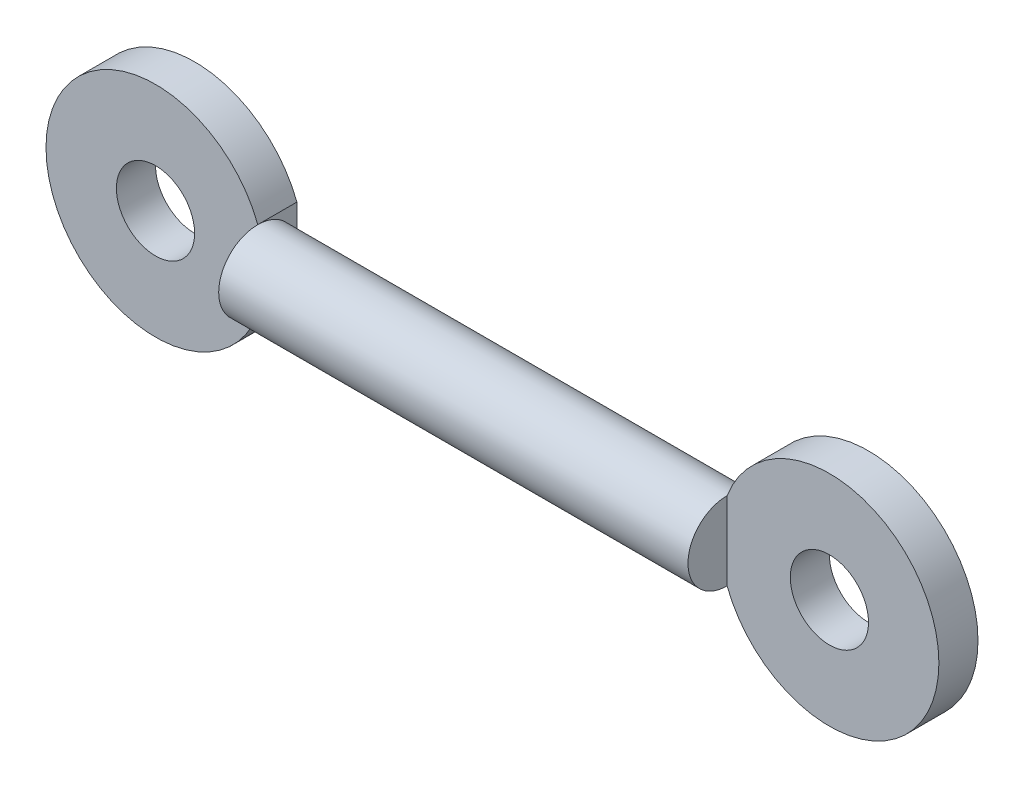
ISO-10303-21;
HEADER;
FILE_DESCRIPTION(('STEP AP214'),'2;1');
FILE_NAME('part.step','',(''),(''),'','','');
FILE_SCHEMA(('AUTOMOTIVE_DESIGN { 1 0 10303 214 1 1 1 1 }'));
ENDSEC;
DATA;
#1=APPLICATION_CONTEXT('core data for automotive mechanical design processes');
#2=APPLICATION_PROTOCOL_DEFINITION('international standard','automotive_design',2000,#1);
#3=PRODUCT_CONTEXT('',#1,'mechanical');
#4=PRODUCT('Part','Part','',(#3));
#5=PRODUCT_RELATED_PRODUCT_CATEGORY('part','',(#4));
#6=PRODUCT_DEFINITION_FORMATION('','',#4);
#7=PRODUCT_DEFINITION_CONTEXT('part definition',#1,'design');
#8=PRODUCT_DEFINITION('design','',#6,#7);
#9=PRODUCT_DEFINITION_SHAPE('','',#8);
#10=(LENGTH_UNIT() NAMED_UNIT(*) SI_UNIT(.MILLI.,.METRE.));
#11=(NAMED_UNIT(*) PLANE_ANGLE_UNIT() SI_UNIT($,.RADIAN.));
#12=(NAMED_UNIT(*) SI_UNIT($,.STERADIAN.) SOLID_ANGLE_UNIT());
#13=UNCERTAINTY_MEASURE_WITH_UNIT(LENGTH_MEASURE(1.E-05),#10,'distance_accuracy_value','');
#14=(GEOMETRIC_REPRESENTATION_CONTEXT(3) GLOBAL_UNCERTAINTY_ASSIGNED_CONTEXT((#13)) GLOBAL_UNIT_ASSIGNED_CONTEXT((#10,
#11,#12)) REPRESENTATION_CONTEXT('',''));
#15=CARTESIAN_POINT('',(0.,0.,0.));
#16=DIRECTION('',(0.,0.,1.));
#17=DIRECTION('',(1.,0.,0.));
#18=AXIS2_PLACEMENT_3D('',#15,#16,#17);
#19=CARTESIAN_POINT('',(15.,0.,0.));
#20=DIRECTION('',(-1.,0.,0.));
#21=DIRECTION('',(0.,-1.,0.));
#22=AXIS2_PLACEMENT_3D('',#19,#20,#21);
#23=PLANE('',#22);
#24=DIRECTION('',(0.,-1.,0.));
#25=VECTOR('',#24,1.);
#26=CARTESIAN_POINT('',(15.,2.50000000000001,0.));
#27=LINE('',#26,#25);
#28=CARTESIAN_POINT('',(15.,2.50000000000001,0.));
#29=VERTEX_POINT('',#28);
#30=CARTESIAN_POINT('',(15.,-2.49999999999999,0.));
#31=VERTEX_POINT('',#30);
#32=EDGE_CURVE('E209',#29,#31,#27,.T.);
#33=ORIENTED_EDGE('',*,*,#32,.F.);
#34=CARTESIAN_POINT('',(15.,0.,0.));
#35=DIRECTION('',(-1.,0.,0.));
#36=DIRECTION('',(0.,-1.,0.));
#37=AXIS2_PLACEMENT_3D('',#34,#35,#36);
#38=CIRCLE('',#37,2.5);
#39=EDGE_CURVE('E228',#31,#29,#38,.T.);
#40=ORIENTED_EDGE('',*,*,#39,.F.);
#41=EDGE_LOOP('',(#33,#40));
#42=FACE_BOUND('',#41,.T.);
#43=ADVANCED_FACE('F45',(#42),#23,.F.);
#44=CARTESIAN_POINT('',(-15.,0.,0.));
#45=DIRECTION('',(-1.,0.,0.));
#46=DIRECTION('',(0.,-1.,0.));
#47=AXIS2_PLACEMENT_3D('',#44,#45,#46);
#48=CYLINDRICAL_SURFACE('',#47,2.5);
#49=ORIENTED_EDGE('',*,*,#39,.T.);
#50=CARTESIAN_POINT('',(15.,0.,-2.5));
#51=VERTEX_POINT('',#50);
#52=EDGE_CURVE('E69',#29,#51,#38,.T.);
#53=ORIENTED_EDGE('',*,*,#52,.T.);
#54=EDGE_CURVE('E225',#51,#31,#38,.T.);
#55=ORIENTED_EDGE('',*,*,#54,.T.);
#56=EDGE_LOOP('',(#49,#53,#55));
#57=FACE_BOUND('',#56,.T.);
#58=CARTESIAN_POINT('',(-15.,0.,0.));
#59=DIRECTION('',(-1.,0.,0.));
#60=DIRECTION('',(0.,-1.,0.));
#61=AXIS2_PLACEMENT_3D('',#58,#59,#60);
#62=CIRCLE('',#61,2.5);
#63=CARTESIAN_POINT('',(-15.,-2.5,0.));
#64=VERTEX_POINT('',#63);
#65=CARTESIAN_POINT('',(-15.,2.5,0.));
#66=VERTEX_POINT('',#65);
#67=EDGE_CURVE('E11',#64,#66,#62,.T.);
#68=ORIENTED_EDGE('',*,*,#67,.F.);
#69=CARTESIAN_POINT('',(-15.,0.,-2.5));
#70=VERTEX_POINT('',#69);
#71=EDGE_CURVE('E55',#70,#64,#62,.T.);
#72=ORIENTED_EDGE('',*,*,#71,.F.);
#73=EDGE_CURVE('E54',#66,#70,#62,.T.);
#74=ORIENTED_EDGE('',*,*,#73,.F.);
#75=EDGE_LOOP('',(#68,#72,#74));
#76=FACE_BOUND('',#75,.T.);
#77=ADVANCED_FACE('F47',(#57,#76),#48,.T.);
#78=CARTESIAN_POINT('',(-15.,-2.5,0.));
#79=DIRECTION('',(1.,0.,0.));
#80=DIRECTION('',(0.,1.,0.));
#81=AXIS2_PLACEMENT_3D('',#78,#79,#80);
#82=PLANE('',#81);
#83=ORIENTED_EDGE('',*,*,#67,.T.);
#84=DIRECTION('',(0.,1.,0.));
#85=VECTOR('',#84,1.);
#86=CARTESIAN_POINT('',(-15.,-2.5,0.));
#87=LINE('',#86,#85);
#88=EDGE_CURVE('E111',#64,#66,#87,.T.);
#89=ORIENTED_EDGE('',*,*,#88,.F.);
#90=EDGE_LOOP('',(#83,#89));
#91=FACE_BOUND('',#90,.T.);
#92=ADVANCED_FACE('F123',(#91),#82,.F.);
#93=CARTESIAN_POINT('',(15.,2.50000000000001,-2.5));
#94=DIRECTION('',(-1.,0.,0.));
#95=DIRECTION('',(0.,0.,1.));
#96=AXIS2_PLACEMENT_3D('',#93,#94,#95);
#97=PLANE('',#96);
#98=DIRECTION('',(0.,0.,1.));
#99=VECTOR('',#98,1.);
#100=CARTESIAN_POINT('',(15.,-2.49999999999999,-2.5));
#101=LINE('',#100,#99);
#102=CARTESIAN_POINT('',(15.,-2.49999999999999,-2.5));
#103=VERTEX_POINT('',#102);
#104=EDGE_CURVE('E221',#103,#31,#101,.T.);
#105=ORIENTED_EDGE('',*,*,#104,.T.);
#106=ORIENTED_EDGE('',*,*,#54,.F.);
#107=DIRECTION('',(0.,-1.,0.));
#108=VECTOR('',#107,1.);
#109=CARTESIAN_POINT('',(15.,2.50000000000001,-2.5));
#110=LINE('',#109,#108);
#111=EDGE_CURVE('E208',#51,#103,#110,.T.);
#112=ORIENTED_EDGE('',*,*,#111,.T.);
#113=EDGE_LOOP('',(#105,#106,#112));
#114=FACE_BOUND('',#113,.T.);
#115=ADVANCED_FACE('F125',(#114),#97,.T.);
#116=CARTESIAN_POINT('',(21.538348415311,0.,-2.5));
#117=DIRECTION('',(0.,0.,1.));
#118=DIRECTION('',(1.,0.,0.));
#119=AXIS2_PLACEMENT_3D('',#116,#117,#118);
#120=CYLINDRICAL_SURFACE('',#119,7.);
#121=CARTESIAN_POINT('',(21.538348415311,0.,0.));
#122=DIRECTION('',(0.,0.,1.));
#123=DIRECTION('',(-1.,0.,0.));
#124=AXIS2_PLACEMENT_3D('',#121,#122,#123);
#125=CIRCLE('',#124,7.);
#126=EDGE_CURVE('E200',#31,#29,#125,.T.);
#127=ORIENTED_EDGE('',*,*,#126,.F.);
#128=ORIENTED_EDGE('',*,*,#104,.F.);
#129=CARTESIAN_POINT('',(21.538348415311,0.,-2.5));
#130=DIRECTION('',(0.,0.,1.));
#131=DIRECTION('',(-1.,0.,0.));
#132=AXIS2_PLACEMENT_3D('',#129,#130,#131);
#133=CIRCLE('',#132,7.);
#134=CARTESIAN_POINT('',(15.,2.50000000000001,-2.5));
#135=VERTEX_POINT('',#134);
#136=EDGE_CURVE('E204',#103,#135,#133,.T.);
#137=ORIENTED_EDGE('',*,*,#136,.T.);
#138=DIRECTION('',(0.,0.,1.));
#139=VECTOR('',#138,1.);
#140=CARTESIAN_POINT('',(15.,2.50000000000001,-2.5));
#141=LINE('',#140,#139);
#142=EDGE_CURVE('E214',#135,#29,#141,.T.);
#143=ORIENTED_EDGE('',*,*,#142,.T.);
#144=EDGE_LOOP('',(#127,#128,#137,#143));
#145=FACE_BOUND('',#144,.T.);
#146=ADVANCED_FACE('F130',(#145),#120,.T.);
#147=EDGE_CURVE('E210',#135,#51,#110,.T.);
#148=ORIENTED_EDGE('',*,*,#147,.T.);
#149=ORIENTED_EDGE('',*,*,#52,.F.);
#150=ORIENTED_EDGE('',*,*,#142,.F.);
#151=EDGE_LOOP('',(#148,#149,#150));
#152=FACE_BOUND('',#151,.T.);
#153=ADVANCED_FACE('F133',(#152),#97,.T.);
#154=CARTESIAN_POINT('',(21.538348415311,0.,-2.5));
#155=DIRECTION('',(0.,0.,-1.));
#156=DIRECTION('',(-1.,0.,0.));
#157=AXIS2_PLACEMENT_3D('',#154,#155,#156);
#158=PLANE('',#157);
#159=CARTESIAN_POINT('',(21.538348415311,0.,-2.5));
#160=DIRECTION('',(0.,0.,1.));
#161=DIRECTION('',(1.,0.,0.));
#162=AXIS2_PLACEMENT_3D('',#159,#160,#161);
#163=CIRCLE('',#162,2.5);
#164=CARTESIAN_POINT('',(24.038348415311,0.,-2.5));
#165=VERTEX_POINT('',#164);
#166=EDGE_CURVE('E196',#165,#165,#163,.T.);
#167=ORIENTED_EDGE('',*,*,#166,.T.);
#168=EDGE_LOOP('',(#167));
#169=FACE_BOUND('',#168,.T.);
#170=ORIENTED_EDGE('',*,*,#136,.F.);
#171=ORIENTED_EDGE('',*,*,#111,.F.);
#172=ORIENTED_EDGE('',*,*,#147,.F.);
#173=EDGE_LOOP('',(#170,#171,#172));
#174=FACE_BOUND('',#173,.T.);
#175=ADVANCED_FACE('F144',(#169,#174),#158,.T.);
#176=CARTESIAN_POINT('',(21.538348415311,0.,0.));
#177=DIRECTION('',(0.,0.,-1.));
#178=DIRECTION('',(-1.,0.,0.));
#179=AXIS2_PLACEMENT_3D('',#176,#177,#178);
#180=PLANE('',#179);
#181=CARTESIAN_POINT('',(21.538348415311,0.,0.));
#182=DIRECTION('',(0.,0.,1.));
#183=DIRECTION('',(1.,0.,0.));
#184=AXIS2_PLACEMENT_3D('',#181,#182,#183);
#185=CIRCLE('',#184,2.5);
#186=CARTESIAN_POINT('',(24.038348415311,0.,0.));
#187=VERTEX_POINT('',#186);
#188=EDGE_CURVE('E192',#187,#187,#185,.T.);
#189=ORIENTED_EDGE('',*,*,#188,.F.);
#190=EDGE_LOOP('',(#189));
#191=FACE_BOUND('',#190,.T.);
#192=ORIENTED_EDGE('',*,*,#126,.T.);
#193=ORIENTED_EDGE('',*,*,#32,.T.);
#194=EDGE_LOOP('',(#192,#193));
#195=FACE_BOUND('',#194,.T.);
#196=ADVANCED_FACE('F146',(#191,#195),#180,.F.);
#197=CARTESIAN_POINT('',(21.538348415311,0.,-2.5));
#198=DIRECTION('',(0.,0.,1.));
#199=DIRECTION('',(1.,0.,0.));
#200=AXIS2_PLACEMENT_3D('',#197,#198,#199);
#201=CYLINDRICAL_SURFACE('',#200,2.5);
#202=ORIENTED_EDGE('',*,*,#166,.F.);
#203=EDGE_LOOP('',(#202));
#204=FACE_BOUND('',#203,.T.);
#205=ORIENTED_EDGE('',*,*,#188,.T.);
#206=EDGE_LOOP('',(#205));
#207=FACE_BOUND('',#206,.T.);
#208=ADVANCED_FACE('F149',(#204,#207),#201,.F.);
#209=CARTESIAN_POINT('',(-15.,-2.5,-2.5));
#210=DIRECTION('',(1.,0.,0.));
#211=DIRECTION('',(0.,0.,-1.));
#212=AXIS2_PLACEMENT_3D('',#209,#210,#211);
#213=PLANE('',#212);
#214=DIRECTION('',(0.,1.,0.));
#215=VECTOR('',#214,1.);
#216=CARTESIAN_POINT('',(-15.,-2.5,-2.5));
#217=LINE('',#216,#215);
#218=CARTESIAN_POINT('',(-15.,-2.5,-2.5));
#219=VERTEX_POINT('',#218);
#220=EDGE_CURVE('E180',#219,#70,#217,.T.);
#221=ORIENTED_EDGE('',*,*,#220,.T.);
#222=ORIENTED_EDGE('',*,*,#71,.T.);
#223=DIRECTION('',(0.,0.,1.));
#224=VECTOR('',#223,1.);
#225=CARTESIAN_POINT('',(-15.,-2.5,-2.5));
#226=LINE('',#225,#224);
#227=EDGE_CURVE('E105',#219,#64,#226,.T.);
#228=ORIENTED_EDGE('',*,*,#227,.F.);
#229=EDGE_LOOP('',(#221,#222,#228));
#230=FACE_BOUND('',#229,.T.);
#231=ADVANCED_FACE('F156',(#230),#213,.T.);
#232=CARTESIAN_POINT('',(-21.538348415311,0.,-2.5));
#233=DIRECTION('',(0.,0.,1.));
#234=DIRECTION('',(1.,0.,0.));
#235=AXIS2_PLACEMENT_3D('',#232,#233,#234);
#236=CYLINDRICAL_SURFACE('',#235,7.);
#237=CARTESIAN_POINT('',(-21.538348415311,0.,0.));
#238=DIRECTION('',(0.,0.,1.));
#239=DIRECTION('',(1.,0.,0.));
#240=AXIS2_PLACEMENT_3D('',#237,#238,#239);
#241=CIRCLE('',#240,7.);
#242=EDGE_CURVE('E61',#66,#64,#241,.T.);
#243=ORIENTED_EDGE('',*,*,#242,.F.);
#244=DIRECTION('',(0.,0.,1.));
#245=VECTOR('',#244,1.);
#246=CARTESIAN_POINT('',(-15.,2.5,-2.5));
#247=LINE('',#246,#245);
#248=CARTESIAN_POINT('',(-15.,2.5,-2.5));
#249=VERTEX_POINT('',#248);
#250=EDGE_CURVE('E96',#249,#66,#247,.T.);
#251=ORIENTED_EDGE('',*,*,#250,.F.);
#252=CARTESIAN_POINT('',(-21.538348415311,0.,-2.5));
#253=DIRECTION('',(0.,0.,1.));
#254=DIRECTION('',(1.,0.,0.));
#255=AXIS2_PLACEMENT_3D('',#252,#253,#254);
#256=CIRCLE('',#255,7.);
#257=EDGE_CURVE('E118',#249,#219,#256,.T.);
#258=ORIENTED_EDGE('',*,*,#257,.T.);
#259=ORIENTED_EDGE('',*,*,#227,.T.);
#260=EDGE_LOOP('',(#243,#251,#258,#259));
#261=FACE_BOUND('',#260,.T.);
#262=ADVANCED_FACE('F107',(#261),#236,.T.);
#263=ORIENTED_EDGE('',*,*,#250,.T.);
#264=ORIENTED_EDGE('',*,*,#73,.T.);
#265=EDGE_CURVE('E100',#70,#249,#217,.T.);
#266=ORIENTED_EDGE('',*,*,#265,.T.);
#267=EDGE_LOOP('',(#263,#264,#266));
#268=FACE_BOUND('',#267,.T.);
#269=ADVANCED_FACE('F97',(#268),#213,.T.);
#270=CARTESIAN_POINT('',(-21.538348415311,0.,-2.5));
#271=DIRECTION('',(0.,0.,1.));
#272=DIRECTION('',(1.,0.,0.));
#273=AXIS2_PLACEMENT_3D('',#270,#271,#272);
#274=PLANE('',#273);
#275=CARTESIAN_POINT('',(-21.538348415311,0.,-2.5));
#276=DIRECTION('',(0.,0.,1.));
#277=DIRECTION('',(1.,0.,0.));
#278=AXIS2_PLACEMENT_3D('',#275,#276,#277);
#279=CIRCLE('',#278,2.5);
#280=CARTESIAN_POINT('',(-19.038348415311,0.,-2.5));
#281=VERTEX_POINT('',#280);
#282=EDGE_CURVE('E110',#281,#281,#279,.T.);
#283=ORIENTED_EDGE('',*,*,#282,.T.);
#284=EDGE_LOOP('',(#283));
#285=FACE_BOUND('',#284,.T.);
#286=ORIENTED_EDGE('',*,*,#257,.F.);
#287=ORIENTED_EDGE('',*,*,#265,.F.);
#288=ORIENTED_EDGE('',*,*,#220,.F.);
#289=EDGE_LOOP('',(#286,#287,#288));
#290=FACE_BOUND('',#289,.T.);
#291=ADVANCED_FACE('F162',(#285,#290),#274,.F.);
#292=CARTESIAN_POINT('',(-21.538348415311,0.,0.));
#293=DIRECTION('',(0.,0.,1.));
#294=DIRECTION('',(1.,0.,0.));
#295=AXIS2_PLACEMENT_3D('',#292,#293,#294);
#296=PLANE('',#295);
#297=CARTESIAN_POINT('',(-21.538348415311,0.,0.));
#298=DIRECTION('',(0.,0.,1.));
#299=DIRECTION('',(1.,0.,0.));
#300=AXIS2_PLACEMENT_3D('',#297,#298,#299);
#301=CIRCLE('',#300,2.5);
#302=CARTESIAN_POINT('',(-19.038348415311,0.,0.));
#303=VERTEX_POINT('',#302);
#304=EDGE_CURVE('E188',#303,#303,#301,.T.);
#305=ORIENTED_EDGE('',*,*,#304,.F.);
#306=EDGE_LOOP('',(#305));
#307=FACE_BOUND('',#306,.T.);
#308=ORIENTED_EDGE('',*,*,#242,.T.);
#309=ORIENTED_EDGE('',*,*,#88,.T.);
#310=EDGE_LOOP('',(#308,#309));
#311=FACE_BOUND('',#310,.T.);
#312=ADVANCED_FACE('F114',(#307,#311),#296,.T.);
#313=CARTESIAN_POINT('',(-21.538348415311,0.,-2.5));
#314=DIRECTION('',(0.,0.,1.));
#315=DIRECTION('',(1.,0.,0.));
#316=AXIS2_PLACEMENT_3D('',#313,#314,#315);
#317=CYLINDRICAL_SURFACE('',#316,2.5);
#318=ORIENTED_EDGE('',*,*,#282,.F.);
#319=EDGE_LOOP('',(#318));
#320=FACE_BOUND('',#319,.T.);
#321=ORIENTED_EDGE('',*,*,#304,.T.);
#322=EDGE_LOOP('',(#321));
#323=FACE_BOUND('',#322,.T.);
#324=ADVANCED_FACE('F158',(#320,#323),#317,.F.);
#325=CLOSED_SHELL('',(#43,#77,#92,#115,#146,#153,#175,#196,#208,#231,#262,#269,#291,#312,#324));
#326=MANIFOLD_SOLID_BREP('B2',#325);
#327=ADVANCED_BREP_SHAPE_REPRESENTATION('',(#18,#326),#14);
#328=SHAPE_DEFINITION_REPRESENTATION(#9,#327);
ENDSEC;
END-ISO-10303-21;
